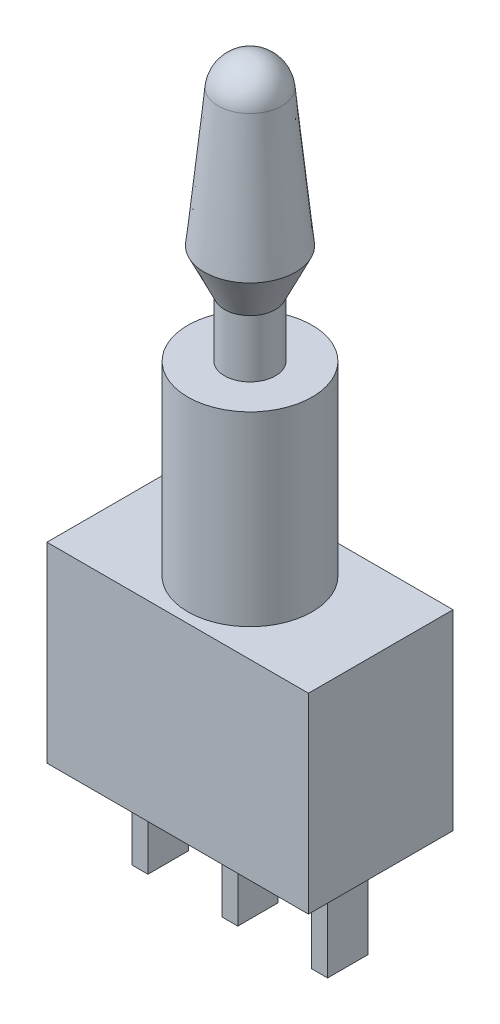
ISO-10303-21;
HEADER;
FILE_DESCRIPTION(('STEP AP214'),'2;1');
FILE_NAME('part.step','',(''),(''),'','','');
FILE_SCHEMA(('AUTOMOTIVE_DESIGN { 1 0 10303 214 1 1 1 1 }'));
ENDSEC;
DATA;
#1=APPLICATION_CONTEXT('core data for automotive mechanical design processes');
#2=APPLICATION_PROTOCOL_DEFINITION('international standard','automotive_design',2000,#1);
#3=PRODUCT_CONTEXT('',#1,'mechanical');
#4=PRODUCT('Part','Part','',(#3));
#5=PRODUCT_RELATED_PRODUCT_CATEGORY('part','',(#4));
#6=PRODUCT_DEFINITION_FORMATION('','',#4);
#7=PRODUCT_DEFINITION_CONTEXT('part definition',#1,'design');
#8=PRODUCT_DEFINITION('design','',#6,#7);
#9=PRODUCT_DEFINITION_SHAPE('','',#8);
#10=(LENGTH_UNIT() NAMED_UNIT(*) SI_UNIT(.MILLI.,.METRE.));
#11=(NAMED_UNIT(*) PLANE_ANGLE_UNIT() SI_UNIT($,.RADIAN.));
#12=(NAMED_UNIT(*) SI_UNIT($,.STERADIAN.) SOLID_ANGLE_UNIT());
#13=UNCERTAINTY_MEASURE_WITH_UNIT(LENGTH_MEASURE(1.E-05),#10,'distance_accuracy_value','');
#14=(GEOMETRIC_REPRESENTATION_CONTEXT(3) GLOBAL_UNCERTAINTY_ASSIGNED_CONTEXT((#13)) GLOBAL_UNIT_ASSIGNED_CONTEXT((#10,
#11,#12)) REPRESENTATION_CONTEXT('',''));
#15=CARTESIAN_POINT('',(0.,0.,0.));
#16=DIRECTION('',(0.,0.,1.));
#17=DIRECTION('',(1.,0.,0.));
#18=AXIS2_PLACEMENT_3D('',#15,#16,#17);
#19=CARTESIAN_POINT('',(0.,0.,0.));
#20=DIRECTION('',(0.,-1.,0.));
#21=DIRECTION('',(0.,0.,-1.));
#22=AXIS2_PLACEMENT_3D('',#19,#20,#21);
#23=PLANE('',#22);
#24=DIRECTION('',(0.,0.,-1.));
#25=VECTOR('',#24,1.);
#26=CARTESIAN_POINT('',(6.15,0.,3.4));
#27=LINE('',#26,#25);
#28=CARTESIAN_POINT('',(6.15,0.,3.4));
#29=VERTEX_POINT('',#28);
#30=CARTESIAN_POINT('',(6.15,0.,-3.4));
#31=VERTEX_POINT('',#30);
#32=EDGE_CURVE('E254',#29,#31,#27,.T.);
#33=ORIENTED_EDGE('',*,*,#32,.F.);
#34=DIRECTION('',(1.,0.,0.));
#35=VECTOR('',#34,1.);
#36=CARTESIAN_POINT('',(-6.15,0.,3.4));
#37=LINE('',#36,#35);
#38=CARTESIAN_POINT('',(-6.15,0.,3.4));
#39=VERTEX_POINT('',#38);
#40=EDGE_CURVE('E260',#39,#29,#37,.T.);
#41=ORIENTED_EDGE('',*,*,#40,.F.);
#42=DIRECTION('',(0.,0.,1.));
#43=VECTOR('',#42,1.);
#44=CARTESIAN_POINT('',(-6.15,0.,3.4));
#45=LINE('',#44,#43);
#46=CARTESIAN_POINT('',(-6.15,0.,-3.4));
#47=VERTEX_POINT('',#46);
#48=EDGE_CURVE('E271',#47,#39,#45,.T.);
#49=ORIENTED_EDGE('',*,*,#48,.F.);
#50=DIRECTION('',(-1.,0.,0.));
#51=VECTOR('',#50,1.);
#52=CARTESIAN_POINT('',(-6.15,0.,-3.4));
#53=LINE('',#52,#51);
#54=EDGE_CURVE('E269',#31,#47,#53,.T.);
#55=ORIENTED_EDGE('',*,*,#54,.F.);
#56=EDGE_LOOP('',(#33,#41,#49,#55));
#57=FACE_BOUND('',#56,.T.);
#58=DIRECTION('',(-1.,0.,0.));
#59=VECTOR('',#58,1.);
#60=CARTESIAN_POINT('',(-0.375,0.,0.95));
#61=LINE('',#60,#59);
#62=CARTESIAN_POINT('',(0.375,0.,0.95));
#63=VERTEX_POINT('',#62);
#64=CARTESIAN_POINT('',(-0.375,0.,0.95));
#65=VERTEX_POINT('',#64);
#66=EDGE_CURVE('E225',#63,#65,#61,.T.);
#67=ORIENTED_EDGE('',*,*,#66,.F.);
#68=DIRECTION('',(0.,0.,1.));
#69=VECTOR('',#68,1.);
#70=CARTESIAN_POINT('',(0.375,0.,-0.95));
#71=LINE('',#70,#69);
#72=CARTESIAN_POINT('',(0.375,0.,-0.95));
#73=VERTEX_POINT('',#72);
#74=EDGE_CURVE('E211',#73,#63,#71,.T.);
#75=ORIENTED_EDGE('',*,*,#74,.F.);
#76=DIRECTION('',(1.,0.,0.));
#77=VECTOR('',#76,1.);
#78=CARTESIAN_POINT('',(-0.375,0.,-0.95));
#79=LINE('',#78,#77);
#80=CARTESIAN_POINT('',(-0.375,0.,-0.95));
#81=VERTEX_POINT('',#80);
#82=EDGE_CURVE('E216',#81,#73,#79,.T.);
#83=ORIENTED_EDGE('',*,*,#82,.F.);
#84=DIRECTION('',(0.,0.,-1.));
#85=VECTOR('',#84,1.);
#86=CARTESIAN_POINT('',(-0.375,0.,-0.95));
#87=LINE('',#86,#85);
#88=EDGE_CURVE('E227',#65,#81,#87,.T.);
#89=ORIENTED_EDGE('',*,*,#88,.F.);
#90=EDGE_LOOP('',(#67,#75,#83,#89));
#91=FACE_BOUND('',#90,.T.);
#92=DIRECTION('',(-1.,0.,0.));
#93=VECTOR('',#92,1.);
#94=CARTESIAN_POINT('',(-4.6,0.,0.95));
#95=LINE('',#94,#93);
#96=CARTESIAN_POINT('',(-3.85,0.,0.95));
#97=VERTEX_POINT('',#96);
#98=CARTESIAN_POINT('',(-4.6,0.,0.95));
#99=VERTEX_POINT('',#98);
#100=EDGE_CURVE('E183',#97,#99,#95,.T.);
#101=ORIENTED_EDGE('',*,*,#100,.F.);
#102=DIRECTION('',(0.,0.,1.));
#103=VECTOR('',#102,1.);
#104=CARTESIAN_POINT('',(-3.85,0.,-0.95));
#105=LINE('',#104,#103);
#106=CARTESIAN_POINT('',(-3.85,0.,-0.95));
#107=VERTEX_POINT('',#106);
#108=EDGE_CURVE('E180',#107,#97,#105,.T.);
#109=ORIENTED_EDGE('',*,*,#108,.F.);
#110=DIRECTION('',(1.,0.,0.));
#111=VECTOR('',#110,1.);
#112=CARTESIAN_POINT('',(-4.6,0.,-0.95));
#113=LINE('',#112,#111);
#114=CARTESIAN_POINT('',(-4.6,0.,-0.95));
#115=VERTEX_POINT('',#114);
#116=EDGE_CURVE('E192',#115,#107,#113,.T.);
#117=ORIENTED_EDGE('',*,*,#116,.F.);
#118=DIRECTION('',(0.,0.,-1.));
#119=VECTOR('',#118,1.);
#120=CARTESIAN_POINT('',(-4.6,0.,-0.95));
#121=LINE('',#120,#119);
#122=EDGE_CURVE('E200',#99,#115,#121,.T.);
#123=ORIENTED_EDGE('',*,*,#122,.F.);
#124=EDGE_LOOP('',(#101,#109,#117,#123));
#125=FACE_BOUND('',#124,.T.);
#126=DIRECTION('',(-1.,0.,0.));
#127=VECTOR('',#126,1.);
#128=CARTESIAN_POINT('',(3.85,0.,0.95));
#129=LINE('',#128,#127);
#130=CARTESIAN_POINT('',(4.6,0.,0.95));
#131=VERTEX_POINT('',#130);
#132=CARTESIAN_POINT('',(3.85,0.,0.95));
#133=VERTEX_POINT('',#132);
#134=EDGE_CURVE('E554',#131,#133,#129,.T.);
#135=ORIENTED_EDGE('',*,*,#134,.F.);
#136=DIRECTION('',(0.,0.,1.));
#137=VECTOR('',#136,1.);
#138=CARTESIAN_POINT('',(4.6,0.,-0.95));
#139=LINE('',#138,#137);
#140=CARTESIAN_POINT('',(4.6,0.,-0.95));
#141=VERTEX_POINT('',#140);
#142=EDGE_CURVE('E178',#141,#131,#139,.T.);
#143=ORIENTED_EDGE('',*,*,#142,.F.);
#144=DIRECTION('',(1.,0.,0.));
#145=VECTOR('',#144,1.);
#146=CARTESIAN_POINT('',(3.85,0.,-0.95));
#147=LINE('',#146,#145);
#148=CARTESIAN_POINT('',(3.85,0.,-0.95));
#149=VERTEX_POINT('',#148);
#150=EDGE_CURVE('E174',#149,#141,#147,.T.);
#151=ORIENTED_EDGE('',*,*,#150,.F.);
#152=DIRECTION('',(0.,0.,-1.));
#153=VECTOR('',#152,1.);
#154=CARTESIAN_POINT('',(3.85,0.,-0.95));
#155=LINE('',#154,#153);
#156=EDGE_CURVE('E551',#133,#149,#155,.T.);
#157=ORIENTED_EDGE('',*,*,#156,.F.);
#158=EDGE_LOOP('',(#135,#143,#151,#157));
#159=FACE_BOUND('',#158,.T.);
#160=ADVANCED_FACE('F40',(#57,#91,#125,#159),#23,.T.);
#161=CARTESIAN_POINT('',(6.15,9.,3.4));
#162=DIRECTION('',(-1.,0.,0.));
#163=DIRECTION('',(0.,0.,1.));
#164=AXIS2_PLACEMENT_3D('',#161,#162,#163);
#165=PLANE('',#164);
#166=ORIENTED_EDGE('',*,*,#32,.T.);
#167=DIRECTION('',(0.,-1.,0.));
#168=VECTOR('',#167,1.);
#169=CARTESIAN_POINT('',(6.15,9.,-3.4));
#170=LINE('',#169,#168);
#171=CARTESIAN_POINT('',(6.15,9.,-3.4));
#172=VERTEX_POINT('',#171);
#173=EDGE_CURVE('E44',#172,#31,#170,.T.);
#174=ORIENTED_EDGE('',*,*,#173,.F.);
#175=DIRECTION('',(0.,0.,-1.));
#176=VECTOR('',#175,1.);
#177=CARTESIAN_POINT('',(6.15,9.,3.4));
#178=LINE('',#177,#176);
#179=CARTESIAN_POINT('',(6.15,9.,3.4));
#180=VERTEX_POINT('',#179);
#181=EDGE_CURVE('E256',#180,#172,#178,.T.);
#182=ORIENTED_EDGE('',*,*,#181,.F.);
#183=DIRECTION('',(0.,-1.,0.));
#184=VECTOR('',#183,1.);
#185=CARTESIAN_POINT('',(6.15,9.,3.4));
#186=LINE('',#185,#184);
#187=EDGE_CURVE('E266',#180,#29,#186,.T.);
#188=ORIENTED_EDGE('',*,*,#187,.T.);
#189=EDGE_LOOP('',(#166,#174,#182,#188));
#190=FACE_BOUND('',#189,.T.);
#191=ADVANCED_FACE('F42',(#190),#165,.F.);
#192=CARTESIAN_POINT('',(-6.15,9.,-3.4));
#193=DIRECTION('',(0.,0.,1.));
#194=DIRECTION('',(1.,0.,0.));
#195=AXIS2_PLACEMENT_3D('',#192,#193,#194);
#196=PLANE('',#195);
#197=ORIENTED_EDGE('',*,*,#54,.T.);
#198=DIRECTION('',(0.,-1.,0.));
#199=VECTOR('',#198,1.);
#200=CARTESIAN_POINT('',(-6.15,9.,-3.4));
#201=LINE('',#200,#199);
#202=CARTESIAN_POINT('',(-6.15,9.,-3.4));
#203=VERTEX_POINT('',#202);
#204=EDGE_CURVE('E278',#203,#47,#201,.T.);
#205=ORIENTED_EDGE('',*,*,#204,.F.);
#206=DIRECTION('',(-1.,0.,0.));
#207=VECTOR('',#206,1.);
#208=CARTESIAN_POINT('',(-6.15,9.,-3.4));
#209=LINE('',#208,#207);
#210=EDGE_CURVE('E259',#172,#203,#209,.T.);
#211=ORIENTED_EDGE('',*,*,#210,.F.);
#212=ORIENTED_EDGE('',*,*,#173,.T.);
#213=EDGE_LOOP('',(#197,#205,#211,#212));
#214=FACE_BOUND('',#213,.T.);
#215=ADVANCED_FACE('F287',(#214),#196,.F.);
#216=CARTESIAN_POINT('',(-6.15,9.,3.4));
#217=DIRECTION('',(1.,0.,0.));
#218=DIRECTION('',(0.,0.,-1.));
#219=AXIS2_PLACEMENT_3D('',#216,#217,#218);
#220=PLANE('',#219);
#221=ORIENTED_EDGE('',*,*,#48,.T.);
#222=DIRECTION('',(0.,-1.,0.));
#223=VECTOR('',#222,1.);
#224=CARTESIAN_POINT('',(-6.15,9.,3.4));
#225=LINE('',#224,#223);
#226=CARTESIAN_POINT('',(-6.15,9.,3.4));
#227=VERTEX_POINT('',#226);
#228=EDGE_CURVE('E276',#227,#39,#225,.T.);
#229=ORIENTED_EDGE('',*,*,#228,.F.);
#230=DIRECTION('',(0.,0.,1.));
#231=VECTOR('',#230,1.);
#232=CARTESIAN_POINT('',(-6.15,9.,3.4));
#233=LINE('',#232,#231);
#234=EDGE_CURVE('E262',#203,#227,#233,.T.);
#235=ORIENTED_EDGE('',*,*,#234,.F.);
#236=ORIENTED_EDGE('',*,*,#204,.T.);
#237=EDGE_LOOP('',(#221,#229,#235,#236));
#238=FACE_BOUND('',#237,.T.);
#239=ADVANCED_FACE('F296',(#238),#220,.F.);
#240=CARTESIAN_POINT('',(-6.15,9.,3.4));
#241=DIRECTION('',(0.,0.,-1.));
#242=DIRECTION('',(-1.,0.,0.));
#243=AXIS2_PLACEMENT_3D('',#240,#241,#242);
#244=PLANE('',#243);
#245=ORIENTED_EDGE('',*,*,#40,.T.);
#246=ORIENTED_EDGE('',*,*,#187,.F.);
#247=DIRECTION('',(1.,0.,0.));
#248=VECTOR('',#247,1.);
#249=CARTESIAN_POINT('',(-6.15,9.,3.4));
#250=LINE('',#249,#248);
#251=EDGE_CURVE('E264',#227,#180,#250,.T.);
#252=ORIENTED_EDGE('',*,*,#251,.F.);
#253=ORIENTED_EDGE('',*,*,#228,.T.);
#254=EDGE_LOOP('',(#245,#246,#252,#253));
#255=FACE_BOUND('',#254,.T.);
#256=ADVANCED_FACE('F299',(#255),#244,.F.);
#257=CARTESIAN_POINT('',(0.,9.,0.));
#258=DIRECTION('',(0.,-1.,0.));
#259=DIRECTION('',(0.,0.,-1.));
#260=AXIS2_PLACEMENT_3D('',#257,#258,#259);
#261=PLANE('',#260);
#262=CARTESIAN_POINT('',(0.,9.,0.));
#263=DIRECTION('',(0.,1.,0.));
#264=DIRECTION('',(0.,0.,1.));
#265=AXIS2_PLACEMENT_3D('',#262,#263,#264);
#266=CIRCLE('',#265,2.925);
#267=CARTESIAN_POINT('',(0.,9.,2.925));
#268=VERTEX_POINT('',#267);
#269=EDGE_CURVE('E11',#268,#268,#266,.T.);
#270=ORIENTED_EDGE('',*,*,#269,.F.);
#271=EDGE_LOOP('',(#270));
#272=FACE_BOUND('',#271,.T.);
#273=ORIENTED_EDGE('',*,*,#181,.T.);
#274=ORIENTED_EDGE('',*,*,#210,.T.);
#275=ORIENTED_EDGE('',*,*,#234,.T.);
#276=ORIENTED_EDGE('',*,*,#251,.T.);
#277=EDGE_LOOP('',(#273,#274,#275,#276));
#278=FACE_BOUND('',#277,.T.);
#279=ADVANCED_FACE('F301',(#272,#278),#261,.F.);
#280=CARTESIAN_POINT('',(0.,17.75,0.));
#281=DIRECTION('',(0.,-1.,0.));
#282=DIRECTION('',(0.,0.,-1.));
#283=AXIS2_PLACEMENT_3D('',#280,#281,#282);
#284=CYLINDRICAL_SURFACE('',#283,2.925);
#285=CARTESIAN_POINT('',(0.,17.75,0.));
#286=DIRECTION('',(0.,1.,0.));
#287=DIRECTION('',(0.,0.,1.));
#288=AXIS2_PLACEMENT_3D('',#285,#286,#287);
#289=CIRCLE('',#288,2.925);
#290=CARTESIAN_POINT('',(0.,17.75,2.925));
#291=VERTEX_POINT('',#290);
#292=EDGE_CURVE('E252',#291,#291,#289,.T.);
#293=ORIENTED_EDGE('',*,*,#292,.F.);
#294=EDGE_LOOP('',(#293));
#295=FACE_BOUND('',#294,.T.);
#296=ORIENTED_EDGE('',*,*,#269,.T.);
#297=EDGE_LOOP('',(#296));
#298=FACE_BOUND('',#297,.T.);
#299=ADVANCED_FACE('F303',(#295,#298),#284,.T.);
#300=CARTESIAN_POINT('',(0.,17.75,0.));
#301=DIRECTION('',(0.,1.,0.));
#302=DIRECTION('',(0.,0.,1.));
#303=AXIS2_PLACEMENT_3D('',#300,#301,#302);
#304=PLANE('',#303);
#305=CARTESIAN_POINT('',(0.,17.75,0.));
#306=DIRECTION('',(0.,-1.,0.));
#307=DIRECTION('',(1.,0.,0.));
#308=AXIS2_PLACEMENT_3D('',#305,#306,#307);
#309=CIRCLE('',#308,1.2);
#310=CARTESIAN_POINT('',(1.2,17.75,0.));
#311=VERTEX_POINT('',#310);
#312=EDGE_CURVE('E249',#311,#311,#309,.T.);
#313=ORIENTED_EDGE('',*,*,#312,.T.);
#314=EDGE_LOOP('',(#313));
#315=FACE_BOUND('',#314,.T.);
#316=ORIENTED_EDGE('',*,*,#292,.T.);
#317=EDGE_LOOP('',(#316));
#318=FACE_BOUND('',#317,.T.);
#319=ADVANCED_FACE('F310',(#315,#318),#304,.T.);
#320=CARTESIAN_POINT('',(3.43024899888577E-12,-982.25,0.));
#321=DIRECTION('',(0.,-1.,0.));
#322=DIRECTION('',(1.,0.,0.));
#323=AXIS2_PLACEMENT_3D('',#320,#321,#322);
#324=CYLINDRICAL_SURFACE('',#323,1.2);
#325=CARTESIAN_POINT('',(0.,20.45,0.));
#326=DIRECTION('',(0.,-1.,0.));
#327=DIRECTION('',(1.,0.,0.));
#328=AXIS2_PLACEMENT_3D('',#325,#326,#327);
#329=CIRCLE('',#328,1.20000000000001);
#330=CARTESIAN_POINT('',(1.2,20.45,0.));
#331=VERTEX_POINT('',#330);
#332=EDGE_CURVE('E246',#331,#331,#329,.T.);
#333=ORIENTED_EDGE('',*,*,#332,.T.);
#334=EDGE_LOOP('',(#333));
#335=FACE_BOUND('',#334,.T.);
#336=ORIENTED_EDGE('',*,*,#312,.F.);
#337=EDGE_LOOP('',(#336));
#338=FACE_BOUND('',#337,.T.);
#339=ADVANCED_FACE('F354',(#335,#338),#324,.T.);
#340=CARTESIAN_POINT('',(0.,20.45,0.));
#341=DIRECTION('',(0.,1.,0.));
#342=DIRECTION('',(-1.,0.,0.));
#343=AXIS2_PLACEMENT_3D('',#340,#341,#342);
#344=CONICAL_SURFACE('',#343,1.20000000000001,0.443448336419741);
#345=CARTESIAN_POINT('',(0.,22.45,0.));
#346=DIRECTION('',(0.,-1.,0.));
#347=DIRECTION('',(1.,0.,0.));
#348=AXIS2_PLACEMENT_3D('',#345,#346,#347);
#349=CIRCLE('',#348,2.15000000000002);
#350=CARTESIAN_POINT('',(2.15,22.45,0.));
#351=VERTEX_POINT('',#350);
#352=EDGE_CURVE('E243',#351,#351,#349,.T.);
#353=ORIENTED_EDGE('',*,*,#352,.T.);
#354=EDGE_LOOP('',(#353));
#355=FACE_BOUND('',#354,.T.);
#356=ORIENTED_EDGE('',*,*,#332,.F.);
#357=EDGE_LOOP('',(#356));
#358=FACE_BOUND('',#357,.T.);
#359=ADVANCED_FACE('F364',(#355,#358),#344,.T.);
#360=CARTESIAN_POINT('',(0.,22.45,0.));
#361=DIRECTION('',(0.,-1.,0.));
#362=DIRECTION('',(1.,0.,0.));
#363=AXIS2_PLACEMENT_3D('',#360,#361,#362);
#364=CONICAL_SURFACE('',#363,2.15000000000002,0.100533674651747);
#365=CARTESIAN_POINT('',(0.,28.893698303268,0.));
#366=DIRECTION('',(0.,-1.,0.));
#367=DIRECTION('',(1.,0.,0.));
#368=AXIS2_PLACEMENT_3D('',#365,#366,#367);
#369=CIRCLE('',#368,1.50000000000004);
#370=CARTESIAN_POINT('',(1.5,28.893698303268,0.));
#371=VERTEX_POINT('',#370);
#372=EDGE_CURVE('E240',#371,#371,#369,.T.);
#373=ORIENTED_EDGE('',*,*,#372,.T.);
#374=EDGE_LOOP('',(#373));
#375=FACE_BOUND('',#374,.T.);
#376=ORIENTED_EDGE('',*,*,#352,.F.);
#377=EDGE_LOOP('',(#376));
#378=FACE_BOUND('',#377,.T.);
#379=ADVANCED_FACE('F375',(#375,#378),#364,.T.);
#380=CARTESIAN_POINT('',(0.,28.7423876809961,0.));
#381=DIRECTION('',(0.,-1.,0.));
#382=DIRECTION('',(1.,0.,0.));
#383=AXIS2_PLACEMENT_3D('',#380,#381,#382);
#384=SPHERICAL_SURFACE('',#383,1.5076123190039);
#385=ORIENTED_EDGE('',*,*,#372,.F.);
#386=EDGE_LOOP('',(#385));
#387=FACE_BOUND('',#386,.T.);
#388=ADVANCED_FACE('F387',(#387),#384,.T.);
#389=CARTESIAN_POINT('',(0.375,-4.6,-0.95));
#390=DIRECTION('',(-1.,0.,0.));
#391=DIRECTION('',(0.,0.,1.));
#392=AXIS2_PLACEMENT_3D('',#389,#390,#391);
#393=PLANE('',#392);
#394=ORIENTED_EDGE('',*,*,#74,.T.);
#395=DIRECTION('',(0.,1.,0.));
#396=VECTOR('',#395,1.);
#397=CARTESIAN_POINT('',(0.375,-4.6,0.95));
#398=LINE('',#397,#396);
#399=CARTESIAN_POINT('',(0.375,-4.6,0.95));
#400=VERTEX_POINT('',#399);
#401=EDGE_CURVE('E238',#400,#63,#398,.T.);
#402=ORIENTED_EDGE('',*,*,#401,.F.);
#403=DIRECTION('',(0.,0.,1.));
#404=VECTOR('',#403,1.);
#405=CARTESIAN_POINT('',(0.375,-4.6,-0.95));
#406=LINE('',#405,#404);
#407=CARTESIAN_POINT('',(0.375,-4.6,-0.95));
#408=VERTEX_POINT('',#407);
#409=EDGE_CURVE('E212',#408,#400,#406,.T.);
#410=ORIENTED_EDGE('',*,*,#409,.F.);
#411=DIRECTION('',(0.,1.,0.));
#412=VECTOR('',#411,1.);
#413=CARTESIAN_POINT('',(0.375,-4.6,-0.95));
#414=LINE('',#413,#412);
#415=EDGE_CURVE('E222',#408,#73,#414,.T.);
#416=ORIENTED_EDGE('',*,*,#415,.T.);
#417=EDGE_LOOP('',(#394,#402,#410,#416));
#418=FACE_BOUND('',#417,.T.);
#419=ADVANCED_FACE('F396',(#418),#393,.F.);
#420=CARTESIAN_POINT('',(-0.375,-4.6,0.95));
#421=DIRECTION('',(0.,0.,-1.));
#422=DIRECTION('',(-1.,0.,0.));
#423=AXIS2_PLACEMENT_3D('',#420,#421,#422);
#424=PLANE('',#423);
#425=ORIENTED_EDGE('',*,*,#66,.T.);
#426=DIRECTION('',(0.,1.,0.));
#427=VECTOR('',#426,1.);
#428=CARTESIAN_POINT('',(-0.375,-4.6,0.95));
#429=LINE('',#428,#427);
#430=CARTESIAN_POINT('',(-0.375,-4.6,0.95));
#431=VERTEX_POINT('',#430);
#432=EDGE_CURVE('E235',#431,#65,#429,.T.);
#433=ORIENTED_EDGE('',*,*,#432,.F.);
#434=DIRECTION('',(-1.,0.,0.));
#435=VECTOR('',#434,1.);
#436=CARTESIAN_POINT('',(-0.375,-4.6,0.95));
#437=LINE('',#436,#435);
#438=EDGE_CURVE('E215',#400,#431,#437,.T.);
#439=ORIENTED_EDGE('',*,*,#438,.F.);
#440=ORIENTED_EDGE('',*,*,#401,.T.);
#441=EDGE_LOOP('',(#425,#433,#439,#440));
#442=FACE_BOUND('',#441,.T.);
#443=ADVANCED_FACE('F411',(#442),#424,.F.);
#444=CARTESIAN_POINT('',(-0.375,-4.6,-0.95));
#445=DIRECTION('',(1.,0.,0.));
#446=DIRECTION('',(0.,0.,-1.));
#447=AXIS2_PLACEMENT_3D('',#444,#445,#446);
#448=PLANE('',#447);
#449=ORIENTED_EDGE('',*,*,#88,.T.);
#450=DIRECTION('',(0.,1.,0.));
#451=VECTOR('',#450,1.);
#452=CARTESIAN_POINT('',(-0.375,-4.6,-0.95));
#453=LINE('',#452,#451);
#454=CARTESIAN_POINT('',(-0.375,-4.6,-0.95));
#455=VERTEX_POINT('',#454);
#456=EDGE_CURVE('E233',#455,#81,#453,.T.);
#457=ORIENTED_EDGE('',*,*,#456,.F.);
#458=DIRECTION('',(0.,0.,-1.));
#459=VECTOR('',#458,1.);
#460=CARTESIAN_POINT('',(-0.375,-4.6,-0.95));
#461=LINE('',#460,#459);
#462=EDGE_CURVE('E218',#431,#455,#461,.T.);
#463=ORIENTED_EDGE('',*,*,#462,.F.);
#464=ORIENTED_EDGE('',*,*,#432,.T.);
#465=EDGE_LOOP('',(#449,#457,#463,#464));
#466=FACE_BOUND('',#465,.T.);
#467=ADVANCED_FACE('F421',(#466),#448,.F.);
#468=CARTESIAN_POINT('',(-0.375,-4.6,-0.95));
#469=DIRECTION('',(0.,0.,1.));
#470=DIRECTION('',(1.,0.,0.));
#471=AXIS2_PLACEMENT_3D('',#468,#469,#470);
#472=PLANE('',#471);
#473=ORIENTED_EDGE('',*,*,#82,.T.);
#474=ORIENTED_EDGE('',*,*,#415,.F.);
#475=DIRECTION('',(1.,0.,0.));
#476=VECTOR('',#475,1.);
#477=CARTESIAN_POINT('',(-0.375,-4.6,-0.95));
#478=LINE('',#477,#476);
#479=EDGE_CURVE('E220',#455,#408,#478,.T.);
#480=ORIENTED_EDGE('',*,*,#479,.F.);
#481=ORIENTED_EDGE('',*,*,#456,.T.);
#482=EDGE_LOOP('',(#473,#474,#480,#481));
#483=FACE_BOUND('',#482,.T.);
#484=ADVANCED_FACE('F431',(#483),#472,.F.);
#485=CARTESIAN_POINT('',(0.,-4.6,0.));
#486=DIRECTION('',(0.,1.,0.));
#487=DIRECTION('',(0.,0.,1.));
#488=AXIS2_PLACEMENT_3D('',#485,#486,#487);
#489=PLANE('',#488);
#490=ORIENTED_EDGE('',*,*,#409,.T.);
#491=ORIENTED_EDGE('',*,*,#438,.T.);
#492=ORIENTED_EDGE('',*,*,#462,.T.);
#493=ORIENTED_EDGE('',*,*,#479,.T.);
#494=EDGE_LOOP('',(#490,#491,#492,#493));
#495=FACE_BOUND('',#494,.T.);
#496=ADVANCED_FACE('F441',(#495),#489,.F.);
#497=CARTESIAN_POINT('',(-3.85,-4.6,-0.95));
#498=DIRECTION('',(-1.,0.,0.));
#499=DIRECTION('',(0.,0.,1.));
#500=AXIS2_PLACEMENT_3D('',#497,#498,#499);
#501=PLANE('',#500);
#502=ORIENTED_EDGE('',*,*,#108,.T.);
#503=DIRECTION('',(0.,1.,0.));
#504=VECTOR('',#503,1.);
#505=CARTESIAN_POINT('',(-3.85,-4.6,0.95));
#506=LINE('',#505,#504);
#507=CARTESIAN_POINT('',(-3.85,-4.6,0.95));
#508=VERTEX_POINT('',#507);
#509=EDGE_CURVE('E209',#508,#97,#506,.T.);
#510=ORIENTED_EDGE('',*,*,#509,.F.);
#511=DIRECTION('',(0.,0.,1.));
#512=VECTOR('',#511,1.);
#513=CARTESIAN_POINT('',(-3.85,-4.6,-0.95));
#514=LINE('',#513,#512);
#515=CARTESIAN_POINT('',(-3.85,-4.6,-0.95));
#516=VERTEX_POINT('',#515);
#517=EDGE_CURVE('E188',#516,#508,#514,.T.);
#518=ORIENTED_EDGE('',*,*,#517,.F.);
#519=DIRECTION('',(0.,1.,0.));
#520=VECTOR('',#519,1.);
#521=CARTESIAN_POINT('',(-3.85,-4.6,-0.95));
#522=LINE('',#521,#520);
#523=EDGE_CURVE('E197',#516,#107,#522,.T.);
#524=ORIENTED_EDGE('',*,*,#523,.T.);
#525=EDGE_LOOP('',(#502,#510,#518,#524));
#526=FACE_BOUND('',#525,.T.);
#527=ADVANCED_FACE('F451',(#526),#501,.F.);
#528=CARTESIAN_POINT('',(-4.6,-4.6,0.95));
#529=DIRECTION('',(0.,0.,-1.));
#530=DIRECTION('',(-1.,0.,0.));
#531=AXIS2_PLACEMENT_3D('',#528,#529,#530);
#532=PLANE('',#531);
#533=ORIENTED_EDGE('',*,*,#100,.T.);
#534=DIRECTION('',(0.,1.,0.));
#535=VECTOR('',#534,1.);
#536=CARTESIAN_POINT('',(-4.6,-4.6,0.95));
#537=LINE('',#536,#535);
#538=CARTESIAN_POINT('',(-4.6,-4.6,0.95));
#539=VERTEX_POINT('',#538);
#540=EDGE_CURVE('E206',#539,#99,#537,.T.);
#541=ORIENTED_EDGE('',*,*,#540,.F.);
#542=DIRECTION('',(-1.,0.,0.));
#543=VECTOR('',#542,1.);
#544=CARTESIAN_POINT('',(-4.6,-4.6,0.95));
#545=LINE('',#544,#543);
#546=EDGE_CURVE('E191',#508,#539,#545,.T.);
#547=ORIENTED_EDGE('',*,*,#546,.F.);
#548=ORIENTED_EDGE('',*,*,#509,.T.);
#549=EDGE_LOOP('',(#533,#541,#547,#548));
#550=FACE_BOUND('',#549,.T.);
#551=ADVANCED_FACE('F461',(#550),#532,.F.);
#552=CARTESIAN_POINT('',(-4.6,-4.6,-0.95));
#553=DIRECTION('',(1.,0.,0.));
#554=DIRECTION('',(0.,0.,-1.));
#555=AXIS2_PLACEMENT_3D('',#552,#553,#554);
#556=PLANE('',#555);
#557=ORIENTED_EDGE('',*,*,#122,.T.);
#558=DIRECTION('',(0.,1.,0.));
#559=VECTOR('',#558,1.);
#560=CARTESIAN_POINT('',(-4.6,-4.6,-0.95));
#561=LINE('',#560,#559);
#562=CARTESIAN_POINT('',(-4.6,-4.6,-0.95));
#563=VERTEX_POINT('',#562);
#564=EDGE_CURVE('E64',#563,#115,#561,.T.);
#565=ORIENTED_EDGE('',*,*,#564,.F.);
#566=DIRECTION('',(0.,0.,-1.));
#567=VECTOR('',#566,1.);
#568=CARTESIAN_POINT('',(-4.6,-4.6,-0.95));
#569=LINE('',#568,#567);
#570=EDGE_CURVE('E194',#539,#563,#569,.T.);
#571=ORIENTED_EDGE('',*,*,#570,.F.);
#572=ORIENTED_EDGE('',*,*,#540,.T.);
#573=EDGE_LOOP('',(#557,#565,#571,#572));
#574=FACE_BOUND('',#573,.T.);
#575=ADVANCED_FACE('F471',(#574),#556,.F.);
#576=CARTESIAN_POINT('',(-4.6,-4.6,-0.95));
#577=DIRECTION('',(0.,0.,1.));
#578=DIRECTION('',(1.,0.,0.));
#579=AXIS2_PLACEMENT_3D('',#576,#577,#578);
#580=PLANE('',#579);
#581=ORIENTED_EDGE('',*,*,#116,.T.);
#582=ORIENTED_EDGE('',*,*,#523,.F.);
#583=DIRECTION('',(1.,0.,0.));
#584=VECTOR('',#583,1.);
#585=CARTESIAN_POINT('',(-4.6,-4.6,-0.95));
#586=LINE('',#585,#584);
#587=EDGE_CURVE('E196',#563,#516,#586,.T.);
#588=ORIENTED_EDGE('',*,*,#587,.F.);
#589=ORIENTED_EDGE('',*,*,#564,.T.);
#590=EDGE_LOOP('',(#581,#582,#588,#589));
#591=FACE_BOUND('',#590,.T.);
#592=ADVANCED_FACE('F481',(#591),#580,.F.);
#593=CARTESIAN_POINT('',(0.,-4.6,0.));
#594=DIRECTION('',(0.,1.,0.));
#595=DIRECTION('',(0.,0.,1.));
#596=AXIS2_PLACEMENT_3D('',#593,#594,#595);
#597=PLANE('',#596);
#598=ORIENTED_EDGE('',*,*,#517,.T.);
#599=ORIENTED_EDGE('',*,*,#546,.T.);
#600=ORIENTED_EDGE('',*,*,#570,.T.);
#601=ORIENTED_EDGE('',*,*,#587,.T.);
#602=EDGE_LOOP('',(#598,#599,#600,#601));
#603=FACE_BOUND('',#602,.T.);
#604=ADVANCED_FACE('F491',(#603),#597,.F.);
#605=CARTESIAN_POINT('',(4.6,-4.6,-0.95));
#606=DIRECTION('',(-1.,0.,0.));
#607=DIRECTION('',(0.,0.,1.));
#608=AXIS2_PLACEMENT_3D('',#605,#606,#607);
#609=PLANE('',#608);
#610=ORIENTED_EDGE('',*,*,#142,.T.);
#611=DIRECTION('',(0.,1.,0.));
#612=VECTOR('',#611,1.);
#613=CARTESIAN_POINT('',(4.6,-4.6,0.95));
#614=LINE('',#613,#612);
#615=CARTESIAN_POINT('',(4.6,-4.6,0.95));
#616=VERTEX_POINT('',#615);
#617=EDGE_CURVE('E159',#616,#131,#614,.T.);
#618=ORIENTED_EDGE('',*,*,#617,.F.);
#619=DIRECTION('',(0.,0.,1.));
#620=VECTOR('',#619,1.);
#621=CARTESIAN_POINT('',(4.6,-4.6,-0.95));
#622=LINE('',#621,#620);
#623=CARTESIAN_POINT('',(4.6,-4.6,-0.95));
#624=VERTEX_POINT('',#623);
#625=EDGE_CURVE('E166',#624,#616,#622,.T.);
#626=ORIENTED_EDGE('',*,*,#625,.F.);
#627=DIRECTION('',(0.,1.,0.));
#628=VECTOR('',#627,1.);
#629=CARTESIAN_POINT('',(4.6,-4.6,-0.95));
#630=LINE('',#629,#628);
#631=EDGE_CURVE('E548',#624,#141,#630,.T.);
#632=ORIENTED_EDGE('',*,*,#631,.T.);
#633=EDGE_LOOP('',(#610,#618,#626,#632));
#634=FACE_BOUND('',#633,.T.);
#635=ADVANCED_FACE('F176',(#634),#609,.F.);
#636=CARTESIAN_POINT('',(3.85,-4.6,0.95));
#637=DIRECTION('',(0.,0.,-1.));
#638=DIRECTION('',(-1.,0.,0.));
#639=AXIS2_PLACEMENT_3D('',#636,#637,#638);
#640=PLANE('',#639);
#641=ORIENTED_EDGE('',*,*,#134,.T.);
#642=DIRECTION('',(0.,1.,0.));
#643=VECTOR('',#642,1.);
#644=CARTESIAN_POINT('',(3.85,-4.6,0.95));
#645=LINE('',#644,#643);
#646=CARTESIAN_POINT('',(3.85,-4.6,0.95));
#647=VERTEX_POINT('',#646);
#648=EDGE_CURVE('E162',#647,#133,#645,.T.);
#649=ORIENTED_EDGE('',*,*,#648,.F.);
#650=DIRECTION('',(-1.,0.,0.));
#651=VECTOR('',#650,1.);
#652=CARTESIAN_POINT('',(3.85,-4.6,0.95));
#653=LINE('',#652,#651);
#654=EDGE_CURVE('E155',#616,#647,#653,.T.);
#655=ORIENTED_EDGE('',*,*,#654,.F.);
#656=ORIENTED_EDGE('',*,*,#617,.T.);
#657=EDGE_LOOP('',(#641,#649,#655,#656));
#658=FACE_BOUND('',#657,.T.);
#659=ADVANCED_FACE('F157',(#658),#640,.F.);
#660=CARTESIAN_POINT('',(3.85,-4.6,-0.95));
#661=DIRECTION('',(1.,0.,0.));
#662=DIRECTION('',(0.,0.,-1.));
#663=AXIS2_PLACEMENT_3D('',#660,#661,#662);
#664=PLANE('',#663);
#665=ORIENTED_EDGE('',*,*,#156,.T.);
#666=DIRECTION('',(0.,1.,0.));
#667=VECTOR('',#666,1.);
#668=CARTESIAN_POINT('',(3.85,-4.6,-0.95));
#669=LINE('',#668,#667);
#670=CARTESIAN_POINT('',(3.85,-4.6,-0.95));
#671=VERTEX_POINT('',#670);
#672=EDGE_CURVE('E56',#671,#149,#669,.T.);
#673=ORIENTED_EDGE('',*,*,#672,.F.);
#674=DIRECTION('',(0.,0.,-1.));
#675=VECTOR('',#674,1.);
#676=CARTESIAN_POINT('',(3.85,-4.6,-0.95));
#677=LINE('',#676,#675);
#678=EDGE_CURVE('E165',#647,#671,#677,.T.);
#679=ORIENTED_EDGE('',*,*,#678,.F.);
#680=ORIENTED_EDGE('',*,*,#648,.T.);
#681=EDGE_LOOP('',(#665,#673,#679,#680));
#682=FACE_BOUND('',#681,.T.);
#683=ADVANCED_FACE('F517',(#682),#664,.F.);
#684=CARTESIAN_POINT('',(3.85,-4.6,-0.95));
#685=DIRECTION('',(0.,0.,1.));
#686=DIRECTION('',(1.,0.,0.));
#687=AXIS2_PLACEMENT_3D('',#684,#685,#686);
#688=PLANE('',#687);
#689=ORIENTED_EDGE('',*,*,#150,.T.);
#690=ORIENTED_EDGE('',*,*,#631,.F.);
#691=DIRECTION('',(1.,0.,0.));
#692=VECTOR('',#691,1.);
#693=CARTESIAN_POINT('',(3.85,-4.6,-0.95));
#694=LINE('',#693,#692);
#695=EDGE_CURVE('E170',#671,#624,#694,.T.);
#696=ORIENTED_EDGE('',*,*,#695,.F.);
#697=ORIENTED_EDGE('',*,*,#672,.T.);
#698=EDGE_LOOP('',(#689,#690,#696,#697));
#699=FACE_BOUND('',#698,.T.);
#700=ADVANCED_FACE('F526',(#699),#688,.F.);
#701=CARTESIAN_POINT('',(0.,-4.6,0.));
#702=DIRECTION('',(0.,1.,0.));
#703=DIRECTION('',(0.,0.,1.));
#704=AXIS2_PLACEMENT_3D('',#701,#702,#703);
#705=PLANE('',#704);
#706=ORIENTED_EDGE('',*,*,#625,.T.);
#707=ORIENTED_EDGE('',*,*,#654,.T.);
#708=ORIENTED_EDGE('',*,*,#678,.T.);
#709=ORIENTED_EDGE('',*,*,#695,.T.);
#710=EDGE_LOOP('',(#706,#707,#708,#709));
#711=FACE_BOUND('',#710,.T.);
#712=ADVANCED_FACE('F169',(#711),#705,.F.);
#713=CLOSED_SHELL('',(#160,#191,#215,#239,#256,#279,#299,#319,#339,#359,#379,#388,#419,#443,
#467,#484,#496,#527,#551,#575,#592,#604,#635,#659,#683,#700,#712));
#714=MANIFOLD_SOLID_BREP('B2',#713);
#715=ADVANCED_BREP_SHAPE_REPRESENTATION('',(#18,#714),#14);
#716=SHAPE_DEFINITION_REPRESENTATION(#9,#715);
ENDSEC;
END-ISO-10303-21;
